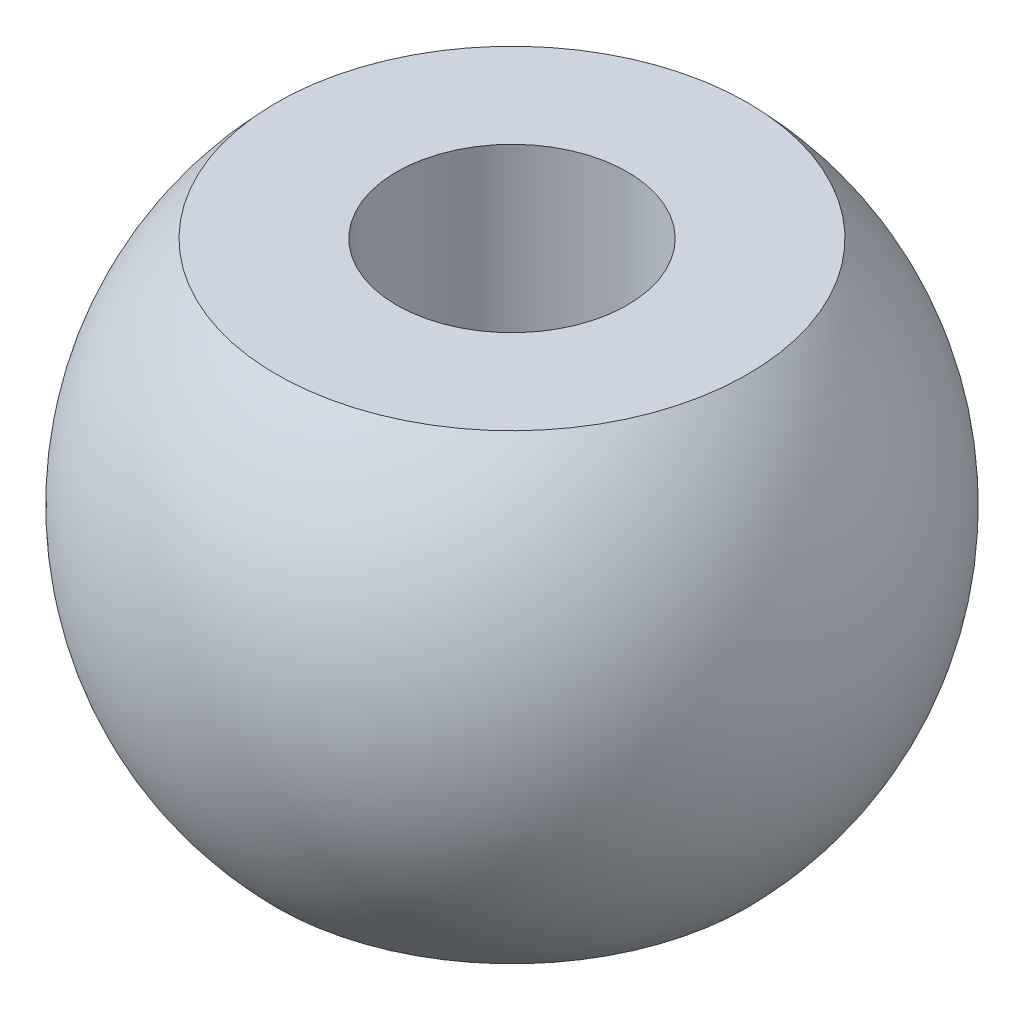
ISO-10303-21;
HEADER;
FILE_DESCRIPTION(('STEP AP214'),'2;1');
FILE_NAME('part.step','',(''),(''),'','','');
FILE_SCHEMA(('AUTOMOTIVE_DESIGN { 1 0 10303 214 1 1 1 1 }'));
ENDSEC;
DATA;
#1=APPLICATION_CONTEXT('core data for automotive mechanical design processes');
#2=APPLICATION_PROTOCOL_DEFINITION('international standard','automotive_design',2000,#1);
#3=PRODUCT_CONTEXT('',#1,'mechanical');
#4=PRODUCT('Part','Part','',(#3));
#5=PRODUCT_RELATED_PRODUCT_CATEGORY('part','',(#4));
#6=PRODUCT_DEFINITION_FORMATION('','',#4);
#7=PRODUCT_DEFINITION_CONTEXT('part definition',#1,'design');
#8=PRODUCT_DEFINITION('design','',#6,#7);
#9=PRODUCT_DEFINITION_SHAPE('','',#8);
#10=(LENGTH_UNIT() NAMED_UNIT(*) SI_UNIT(.MILLI.,.METRE.));
#11=(NAMED_UNIT(*) PLANE_ANGLE_UNIT() SI_UNIT($,.RADIAN.));
#12=(NAMED_UNIT(*) SI_UNIT($,.STERADIAN.) SOLID_ANGLE_UNIT());
#13=UNCERTAINTY_MEASURE_WITH_UNIT(LENGTH_MEASURE(1.E-05),#10,'distance_accuracy_value','');
#14=(GEOMETRIC_REPRESENTATION_CONTEXT(3) GLOBAL_UNCERTAINTY_ASSIGNED_CONTEXT((#13)) GLOBAL_UNIT_ASSIGNED_CONTEXT((#10,
#11,#12)) REPRESENTATION_CONTEXT('',''));
#15=CARTESIAN_POINT('',(0.,0.,0.));
#16=DIRECTION('',(0.,0.,1.));
#17=DIRECTION('',(1.,0.,0.));
#18=AXIS2_PLACEMENT_3D('',#15,#16,#17);
#19=CARTESIAN_POINT('',(0.,10.,0.));
#20=DIRECTION('',(0.,-1.,0.));
#21=DIRECTION('',(-1.,0.,0.));
#22=AXIS2_PLACEMENT_3D('',#19,#20,#21);
#23=SPHERICAL_SURFACE('',#22,10.);
#24=CARTESIAN_POINT('',(0.,3.,0.));
#25=DIRECTION('',(0.,1.,0.));
#26=DIRECTION('',(0.,0.,1.));
#27=AXIS2_PLACEMENT_3D('',#24,#25,#26);
#28=CIRCLE('',#27,7.14142842854285);
#29=CARTESIAN_POINT('',(0.,3.,7.14142842854285));
#30=VERTEX_POINT('',#29);
#31=EDGE_CURVE('E10',#30,#30,#28,.T.);
#32=ORIENTED_EDGE('',*,*,#31,.T.);
#33=EDGE_LOOP('',(#32));
#34=FACE_BOUND('',#33,.T.);
#35=CARTESIAN_POINT('',(0.,17.,0.));
#36=DIRECTION('',(0.,-1.,0.));
#37=DIRECTION('',(0.,0.,-1.));
#38=AXIS2_PLACEMENT_3D('',#35,#36,#37);
#39=CIRCLE('',#38,7.14142842854285);
#40=CARTESIAN_POINT('',(0.,17.,-7.14142842854285));
#41=VERTEX_POINT('',#40);
#42=EDGE_CURVE('E42',#41,#41,#39,.T.);
#43=ORIENTED_EDGE('',*,*,#42,.T.);
#44=EDGE_LOOP('',(#43));
#45=FACE_BOUND('',#44,.T.);
#46=ADVANCED_FACE('F36',(#34,#45),#23,.T.);
#47=CARTESIAN_POINT('',(0.,17.,-10.));
#48=DIRECTION('',(0.,-1.,0.));
#49=DIRECTION('',(0.,0.,-1.));
#50=AXIS2_PLACEMENT_3D('',#47,#48,#49);
#51=PLANE('',#50);
#52=CARTESIAN_POINT('',(0.,17.,0.));
#53=DIRECTION('',(0.,1.,0.));
#54=DIRECTION('',(0.,0.,1.));
#55=AXIS2_PLACEMENT_3D('',#52,#53,#54);
#56=CIRCLE('',#55,3.5);
#57=CARTESIAN_POINT('',(0.,17.,3.5));
#58=VERTEX_POINT('',#57);
#59=EDGE_CURVE('E50',#58,#58,#56,.T.);
#60=ORIENTED_EDGE('',*,*,#59,.F.);
#61=EDGE_LOOP('',(#60));
#62=FACE_BOUND('',#61,.T.);
#63=ORIENTED_EDGE('',*,*,#42,.F.);
#64=EDGE_LOOP('',(#63));
#65=FACE_BOUND('',#64,.T.);
#66=ADVANCED_FACE('F58',(#62,#65),#51,.F.);
#67=CARTESIAN_POINT('',(9.43523549078676,3.,-10.));
#68=DIRECTION('',(0.,1.,0.));
#69=DIRECTION('',(0.,0.,1.));
#70=AXIS2_PLACEMENT_3D('',#67,#68,#69);
#71=PLANE('',#70);
#72=CARTESIAN_POINT('',(0.,3.,0.));
#73=DIRECTION('',(0.,1.,0.));
#74=DIRECTION('',(0.,0.,1.));
#75=AXIS2_PLACEMENT_3D('',#72,#73,#74);
#76=CIRCLE('',#75,3.5);
#77=CARTESIAN_POINT('',(0.,3.,3.5));
#78=VERTEX_POINT('',#77);
#79=EDGE_CURVE('E46',#78,#78,#76,.T.);
#80=ORIENTED_EDGE('',*,*,#79,.T.);
#81=EDGE_LOOP('',(#80));
#82=FACE_BOUND('',#81,.T.);
#83=ORIENTED_EDGE('',*,*,#31,.F.);
#84=EDGE_LOOP('',(#83));
#85=FACE_BOUND('',#84,.T.);
#86=ADVANCED_FACE('F61',(#82,#85),#71,.F.);
#87=CARTESIAN_POINT('',(0.,3.,0.));
#88=DIRECTION('',(0.,1.,0.));
#89=DIRECTION('',(0.,0.,1.));
#90=AXIS2_PLACEMENT_3D('',#87,#88,#89);
#91=CYLINDRICAL_SURFACE('',#90,3.5);
#92=ORIENTED_EDGE('',*,*,#79,.F.);
#93=EDGE_LOOP('',(#92));
#94=FACE_BOUND('',#93,.T.);
#95=ORIENTED_EDGE('',*,*,#59,.T.);
#96=EDGE_LOOP('',(#95));
#97=FACE_BOUND('',#96,.T.);
#98=ADVANCED_FACE('F56',(#94,#97),#91,.F.);
#99=CLOSED_SHELL('',(#46,#66,#86,#98));
#100=MANIFOLD_SOLID_BREP('B2',#99);
#101=ADVANCED_BREP_SHAPE_REPRESENTATION('',(#18,#100),#14);
#102=SHAPE_DEFINITION_REPRESENTATION(#9,#101);
ENDSEC;
END-ISO-10303-21;
